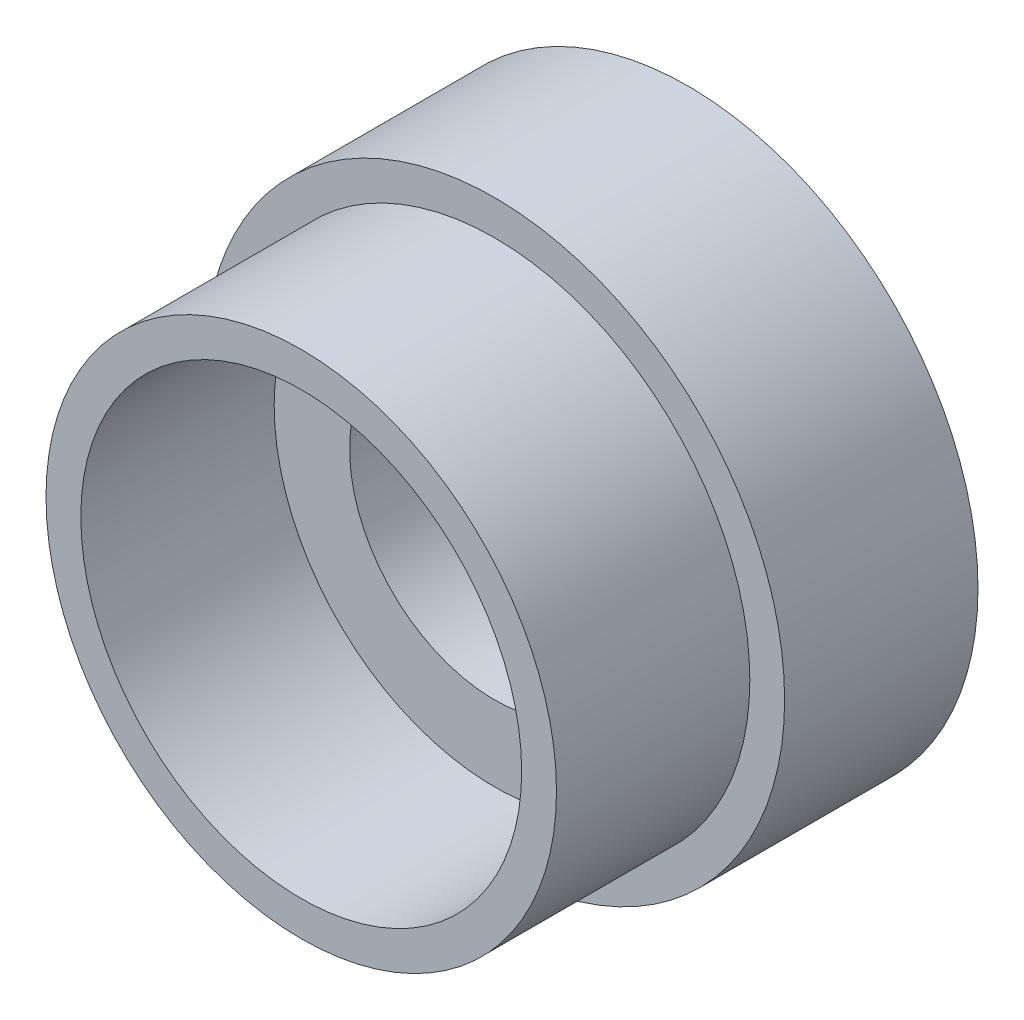
ISO-10303-21;
HEADER;
FILE_DESCRIPTION(('STEP AP214'),'2;1');
FILE_NAME('part.step','',(''),(''),'','','');
FILE_SCHEMA(('AUTOMOTIVE_DESIGN { 1 0 10303 214 1 1 1 1 }'));
ENDSEC;
DATA;
#1=APPLICATION_CONTEXT('core data for automotive mechanical design processes');
#2=APPLICATION_PROTOCOL_DEFINITION('international standard','automotive_design',2000,#1);
#3=PRODUCT_CONTEXT('',#1,'mechanical');
#4=PRODUCT('Part','Part','',(#3));
#5=PRODUCT_RELATED_PRODUCT_CATEGORY('part','',(#4));
#6=PRODUCT_DEFINITION_FORMATION('','',#4);
#7=PRODUCT_DEFINITION_CONTEXT('part definition',#1,'design');
#8=PRODUCT_DEFINITION('design','',#6,#7);
#9=PRODUCT_DEFINITION_SHAPE('','',#8);
#10=(LENGTH_UNIT() NAMED_UNIT(*) SI_UNIT(.MILLI.,.METRE.));
#11=(NAMED_UNIT(*) PLANE_ANGLE_UNIT() SI_UNIT($,.RADIAN.));
#12=(NAMED_UNIT(*) SI_UNIT($,.STERADIAN.) SOLID_ANGLE_UNIT());
#13=UNCERTAINTY_MEASURE_WITH_UNIT(LENGTH_MEASURE(1.E-05),#10,'distance_accuracy_value','');
#14=(GEOMETRIC_REPRESENTATION_CONTEXT(3) GLOBAL_UNCERTAINTY_ASSIGNED_CONTEXT((#13)) GLOBAL_UNIT_ASSIGNED_CONTEXT((#10,
#11,#12)) REPRESENTATION_CONTEXT('',''));
#15=CARTESIAN_POINT('',(0.,0.,0.));
#16=DIRECTION('',(0.,0.,1.));
#17=DIRECTION('',(1.,0.,0.));
#18=AXIS2_PLACEMENT_3D('',#15,#16,#17);
#19=CARTESIAN_POINT('',(0.,0.,6.35));
#20=DIRECTION('',(0.,0.,1.));
#21=DIRECTION('',(1.,0.,0.));
#22=AXIS2_PLACEMENT_3D('',#19,#20,#21);
#23=PLANE('',#22);
#24=CARTESIAN_POINT('',(0.,0.,6.35));
#25=DIRECTION('',(0.,0.,1.));
#26=DIRECTION('',(1.,0.,0.));
#27=AXIS2_PLACEMENT_3D('',#24,#25,#26);
#28=CIRCLE('',#27,4.7625);
#29=CARTESIAN_POINT('',(4.7625,0.,6.35));
#30=VERTEX_POINT('',#29);
#31=EDGE_CURVE('E47',#30,#30,#28,.T.);
#32=ORIENTED_EDGE('',*,*,#31,.F.);
#33=EDGE_LOOP('',(#32));
#34=FACE_BOUND('',#33,.T.);
#35=CARTESIAN_POINT('',(0.,0.,6.35));
#36=DIRECTION('',(0.,0.,1.));
#37=DIRECTION('',(1.,0.,0.));
#38=AXIS2_PLACEMENT_3D('',#35,#36,#37);
#39=CIRCLE('',#38,7.239);
#40=CARTESIAN_POINT('',(7.239,0.,6.35));
#41=VERTEX_POINT('',#40);
#42=EDGE_CURVE('E59',#41,#41,#39,.T.);
#43=ORIENTED_EDGE('',*,*,#42,.T.);
#44=EDGE_LOOP('',(#43));
#45=FACE_BOUND('',#44,.T.);
#46=ADVANCED_FACE('F30',(#34,#45),#23,.T.);
#47=CARTESIAN_POINT('',(0.,0.,6.35));
#48=DIRECTION('',(0.,0.,1.));
#49=DIRECTION('',(1.,0.,0.));
#50=AXIS2_PLACEMENT_3D('',#47,#48,#49);
#51=CIRCLE('',#50,8.382);
#52=CARTESIAN_POINT('',(8.382,0.,6.35));
#53=VERTEX_POINT('',#52);
#54=EDGE_CURVE('E10',#53,#53,#51,.T.);
#55=ORIENTED_EDGE('',*,*,#54,.F.);
#56=EDGE_LOOP('',(#55));
#57=FACE_BOUND('',#56,.T.);
#58=CARTESIAN_POINT('',(0.,0.,6.35));
#59=DIRECTION('',(0.,0.,1.));
#60=DIRECTION('',(1.,0.,0.));
#61=AXIS2_PLACEMENT_3D('',#58,#59,#60);
#62=CIRCLE('',#61,9.525);
#63=CARTESIAN_POINT('',(9.525,0.,6.35));
#64=VERTEX_POINT('',#63);
#65=EDGE_CURVE('E38',#64,#64,#62,.T.);
#66=ORIENTED_EDGE('',*,*,#65,.T.);
#67=EDGE_LOOP('',(#66));
#68=FACE_BOUND('',#67,.T.);
#69=ADVANCED_FACE('F79',(#57,#68),#23,.T.);
#70=CARTESIAN_POINT('',(0.,0.,0.));
#71=DIRECTION('',(0.,0.,1.));
#72=DIRECTION('',(1.,0.,0.));
#73=AXIS2_PLACEMENT_3D('',#70,#71,#72);
#74=PLANE('',#73);
#75=CARTESIAN_POINT('',(0.,0.,0.));
#76=DIRECTION('',(0.,0.,1.));
#77=DIRECTION('',(1.,0.,0.));
#78=AXIS2_PLACEMENT_3D('',#75,#76,#77);
#79=CIRCLE('',#78,9.525);
#80=CARTESIAN_POINT('',(9.525,0.,0.));
#81=VERTEX_POINT('',#80);
#82=EDGE_CURVE('E34',#81,#81,#79,.T.);
#83=ORIENTED_EDGE('',*,*,#82,.F.);
#84=EDGE_LOOP('',(#83));
#85=FACE_BOUND('',#84,.T.);
#86=CARTESIAN_POINT('',(0.,0.,0.));
#87=DIRECTION('',(0.,0.,1.));
#88=DIRECTION('',(1.,0.,0.));
#89=AXIS2_PLACEMENT_3D('',#86,#87,#88);
#90=CIRCLE('',#89,4.7625);
#91=CARTESIAN_POINT('',(4.7625,0.,0.));
#92=VERTEX_POINT('',#91);
#93=EDGE_CURVE('E50',#92,#92,#90,.T.);
#94=ORIENTED_EDGE('',*,*,#93,.T.);
#95=EDGE_LOOP('',(#94));
#96=FACE_BOUND('',#95,.T.);
#97=ADVANCED_FACE('F85',(#85,#96),#74,.F.);
#98=CARTESIAN_POINT('',(0.,0.,6.35));
#99=DIRECTION('',(0.,0.,-1.));
#100=DIRECTION('',(-1.,0.,0.));
#101=AXIS2_PLACEMENT_3D('',#98,#99,#100);
#102=CYLINDRICAL_SURFACE('',#101,9.525);
#103=ORIENTED_EDGE('',*,*,#65,.F.);
#104=EDGE_LOOP('',(#103));
#105=FACE_BOUND('',#104,.T.);
#106=ORIENTED_EDGE('',*,*,#82,.T.);
#107=EDGE_LOOP('',(#106));
#108=FACE_BOUND('',#107,.T.);
#109=ADVANCED_FACE('F32',(#105,#108),#102,.T.);
#110=CARTESIAN_POINT('',(0.,0.,6.35));
#111=DIRECTION('',(0.,0.,-1.));
#112=DIRECTION('',(-1.,0.,0.));
#113=AXIS2_PLACEMENT_3D('',#110,#111,#112);
#114=CYLINDRICAL_SURFACE('',#113,4.7625);
#115=ORIENTED_EDGE('',*,*,#31,.T.);
#116=EDGE_LOOP('',(#115));
#117=FACE_BOUND('',#116,.T.);
#118=ORIENTED_EDGE('',*,*,#93,.F.);
#119=EDGE_LOOP('',(#118));
#120=FACE_BOUND('',#119,.T.);
#121=ADVANCED_FACE('F89',(#117,#120),#114,.F.);
#122=CARTESIAN_POINT('',(0.,0.,12.7));
#123=DIRECTION('',(0.,0.,1.));
#124=DIRECTION('',(1.,0.,0.));
#125=AXIS2_PLACEMENT_3D('',#122,#123,#124);
#126=PLANE('',#125);
#127=CARTESIAN_POINT('',(0.,0.,12.7));
#128=DIRECTION('',(0.,0.,1.));
#129=DIRECTION('',(1.,0.,0.));
#130=AXIS2_PLACEMENT_3D('',#127,#128,#129);
#131=CIRCLE('',#130,8.382);
#132=CARTESIAN_POINT('',(8.382,0.,12.7));
#133=VERTEX_POINT('',#132);
#134=EDGE_CURVE('E45',#133,#133,#131,.T.);
#135=ORIENTED_EDGE('',*,*,#134,.T.);
#136=EDGE_LOOP('',(#135));
#137=FACE_BOUND('',#136,.T.);
#138=CARTESIAN_POINT('',(0.,0.,12.7));
#139=DIRECTION('',(0.,0.,1.));
#140=DIRECTION('',(1.,0.,0.));
#141=AXIS2_PLACEMENT_3D('',#138,#139,#140);
#142=CIRCLE('',#141,7.239);
#143=CARTESIAN_POINT('',(7.239,0.,12.7));
#144=VERTEX_POINT('',#143);
#145=EDGE_CURVE('E55',#144,#144,#142,.T.);
#146=ORIENTED_EDGE('',*,*,#145,.F.);
#147=EDGE_LOOP('',(#146));
#148=FACE_BOUND('',#147,.T.);
#149=ADVANCED_FACE('F74',(#137,#148),#126,.T.);
#150=CARTESIAN_POINT('',(0.,0.,12.7));
#151=DIRECTION('',(0.,0.,-1.));
#152=DIRECTION('',(-1.,0.,0.));
#153=AXIS2_PLACEMENT_3D('',#150,#151,#152);
#154=CYLINDRICAL_SURFACE('',#153,8.382);
#155=ORIENTED_EDGE('',*,*,#134,.F.);
#156=EDGE_LOOP('',(#155));
#157=FACE_BOUND('',#156,.T.);
#158=ORIENTED_EDGE('',*,*,#54,.T.);
#159=EDGE_LOOP('',(#158));
#160=FACE_BOUND('',#159,.T.);
#161=ADVANCED_FACE('F69',(#157,#160),#154,.T.);
#162=CARTESIAN_POINT('',(0.,0.,12.7));
#163=DIRECTION('',(0.,0.,-1.));
#164=DIRECTION('',(-1.,0.,0.));
#165=AXIS2_PLACEMENT_3D('',#162,#163,#164);
#166=CYLINDRICAL_SURFACE('',#165,7.239);
#167=ORIENTED_EDGE('',*,*,#145,.T.);
#168=EDGE_LOOP('',(#167));
#169=FACE_BOUND('',#168,.T.);
#170=ORIENTED_EDGE('',*,*,#42,.F.);
#171=EDGE_LOOP('',(#170));
#172=FACE_BOUND('',#171,.T.);
#173=ADVANCED_FACE('F67',(#169,#172),#166,.F.);
#174=CLOSED_SHELL('',(#46,#69,#97,#109,#121,#149,#161,#173));
#175=MANIFOLD_SOLID_BREP('B2',#174);
#176=ADVANCED_BREP_SHAPE_REPRESENTATION('',(#18,#175),#14);
#177=SHAPE_DEFINITION_REPRESENTATION(#9,#176);
ENDSEC;
END-ISO-10303-21;
